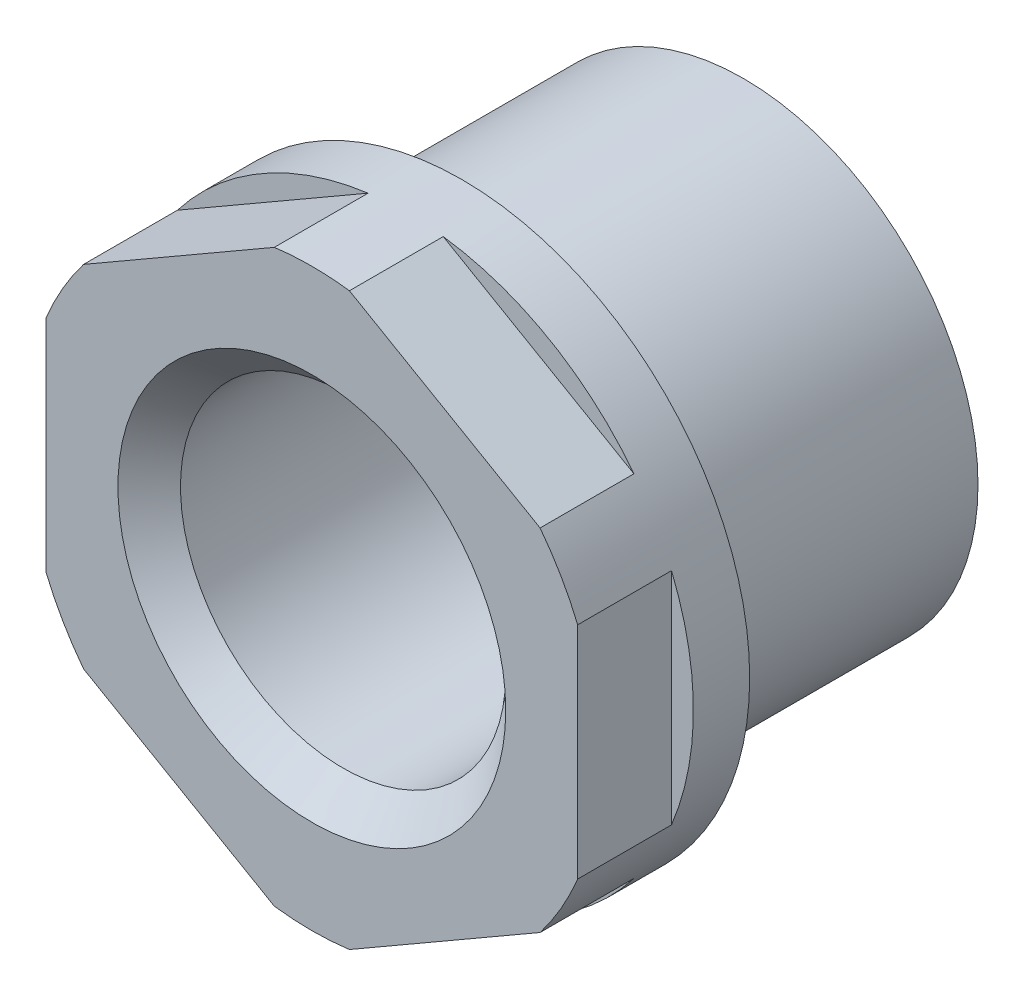
ISO-10303-21;
HEADER;
FILE_DESCRIPTION(('STEP AP214'),'2;1');
FILE_NAME('part.step','',(''),(''),'','','');
FILE_SCHEMA(('AUTOMOTIVE_DESIGN { 1 0 10303 214 1 1 1 1 }'));
ENDSEC;
DATA;
#1=APPLICATION_CONTEXT('core data for automotive mechanical design processes');
#2=APPLICATION_PROTOCOL_DEFINITION('international standard','automotive_design',2000,#1);
#3=PRODUCT_CONTEXT('',#1,'mechanical');
#4=PRODUCT('Part','Part','',(#3));
#5=PRODUCT_RELATED_PRODUCT_CATEGORY('part','',(#4));
#6=PRODUCT_DEFINITION_FORMATION('','',#4);
#7=PRODUCT_DEFINITION_CONTEXT('part definition',#1,'design');
#8=PRODUCT_DEFINITION('design','',#6,#7);
#9=PRODUCT_DEFINITION_SHAPE('','',#8);
#10=(LENGTH_UNIT() NAMED_UNIT(*) SI_UNIT(.MILLI.,.METRE.));
#11=(NAMED_UNIT(*) PLANE_ANGLE_UNIT() SI_UNIT($,.RADIAN.));
#12=(NAMED_UNIT(*) SI_UNIT($,.STERADIAN.) SOLID_ANGLE_UNIT());
#13=UNCERTAINTY_MEASURE_WITH_UNIT(LENGTH_MEASURE(1.E-05),#10,'distance_accuracy_value','');
#14=(GEOMETRIC_REPRESENTATION_CONTEXT(3) GLOBAL_UNCERTAINTY_ASSIGNED_CONTEXT((#13)) GLOBAL_UNIT_ASSIGNED_CONTEXT((#10,
#11,#12)) REPRESENTATION_CONTEXT('',''));
#15=CARTESIAN_POINT('',(0.,0.,0.));
#16=DIRECTION('',(0.,0.,1.));
#17=DIRECTION('',(1.,0.,0.));
#18=AXIS2_PLACEMENT_3D('',#15,#16,#17);
#19=CARTESIAN_POINT('',(-5.86092041698449,40.6504195270786,-29.4999999999845));
#20=DIRECTION('',(0.,0.,1.));
#21=DIRECTION('',(1.,0.,0.));
#22=AXIS2_PLACEMENT_3D('',#19,#20,#21);
#23=CONICAL_SURFACE('',#22,6.19999999996424,0.785398163394924);
#24=CARTESIAN_POINT('',(-5.86092041698449,40.6504195270786,-30.5));
#25=DIRECTION('',(0.,0.,-1.));
#26=DIRECTION('',(0.,1.,0.));
#27=AXIS2_PLACEMENT_3D('',#24,#25,#26);
#28=CIRCLE('',#27,5.2);
#29=CARTESIAN_POINT('',(-5.86092041698449,45.8504195270786,-30.5));
#30=VERTEX_POINT('',#29);
#31=EDGE_CURVE('E132',#30,#30,#28,.T.);
#32=ORIENTED_EDGE('',*,*,#31,.T.);
#33=EDGE_LOOP('',(#32));
#34=FACE_BOUND('',#33,.T.);
#35=CARTESIAN_POINT('',(-5.86092041698449,40.6504195270786,-29.4999999999845));
#36=DIRECTION('',(0.,0.,1.));
#37=DIRECTION('',(1.,0.,0.));
#38=AXIS2_PLACEMENT_3D('',#35,#36,#37);
#39=CIRCLE('',#38,6.19999999996424);
#40=CARTESIAN_POINT('',(0.339079582979749,40.6504195270786,-29.4999999999845));
#41=VERTEX_POINT('',#40);
#42=EDGE_CURVE('E21',#41,#41,#39,.F.);
#43=ORIENTED_EDGE('',*,*,#42,.F.);
#44=EDGE_LOOP('',(#43));
#45=FACE_BOUND('',#44,.T.);
#46=ADVANCED_FACE('F18',(#34,#45),#23,.F.);
#47=CARTESIAN_POINT('',(-5.86092041698449,40.6504195270786,-32.5));
#48=DIRECTION('',(0.,0.,1.));
#49=DIRECTION('',(0.,-1.,0.));
#50=AXIS2_PLACEMENT_3D('',#47,#48,#49);
#51=PLANE('',#50);
#52=CARTESIAN_POINT('',(-5.86092041698449,40.6504195270786,-32.5));
#53=DIRECTION('',(0.,0.,-1.));
#54=DIRECTION('',(0.,1.,0.));
#55=AXIS2_PLACEMENT_3D('',#52,#53,#54);
#56=CIRCLE('',#55,9.2);
#57=CARTESIAN_POINT('',(-13.1592806319197,46.2516638685665,-32.5));
#58=VERTEX_POINT('',#57);
#59=CARTESIAN_POINT('',(-7.06256020204926,49.7716070499261,-32.5));
#60=VERTEX_POINT('',#59);
#61=EDGE_CURVE('E125',#58,#60,#56,.T.);
#62=ORIENTED_EDGE('',*,*,#61,.F.);
#63=DIRECTION('',(0.866025403784439,0.5,0.));
#64=VECTOR('',#63,1.);
#65=CARTESIAN_POINT('',(-7.06256020204925,49.7716070499261,-32.5));
#66=LINE('',#65,#64);
#67=EDGE_CURVE('E121',#58,#60,#66,.T.);
#68=ORIENTED_EDGE('',*,*,#67,.T.);
#69=EDGE_LOOP('',(#62,#68));
#70=FACE_BOUND('',#69,.T.);
#71=ADVANCED_FACE('F247',(#70),#51,.T.);
#72=CARTESIAN_POINT('',(-7.06256020204925,49.7716070499261,-32.5));
#73=DIRECTION('',(0.5,-0.866025403784439,0.));
#74=DIRECTION('',(0.866025403784439,0.5,0.));
#75=AXIS2_PLACEMENT_3D('',#72,#73,#74);
#76=PLANE('',#75);
#77=ORIENTED_EDGE('',*,*,#67,.F.);
#78=DIRECTION('',(0.,0.,-1.));
#79=VECTOR('',#78,1.);
#80=CARTESIAN_POINT('',(-13.1592806319197,46.2516638685665,-34.3));
#81=LINE('',#80,#79);
#82=CARTESIAN_POINT('',(-13.1592806319197,46.2516638685665,-29.5));
#83=VERTEX_POINT('',#82);
#84=EDGE_CURVE('E119',#83,#58,#81,.T.);
#85=ORIENTED_EDGE('',*,*,#84,.F.);
#86=DIRECTION('',(-0.866025403784438,-0.5,0.));
#87=VECTOR('',#86,1.);
#88=CARTESIAN_POINT('',(-7.06256020204925,49.7716070499261,-29.5));
#89=LINE('',#88,#87);
#90=CARTESIAN_POINT('',(-7.06256020204926,49.7716070499261,-29.5));
#91=VERTEX_POINT('',#90);
#92=EDGE_CURVE('E105',#91,#83,#89,.T.);
#93=ORIENTED_EDGE('',*,*,#92,.F.);
#94=DIRECTION('',(0.,0.,-1.));
#95=VECTOR('',#94,1.);
#96=CARTESIAN_POINT('',(-7.06256020204926,49.7716070499261,-34.3));
#97=LINE('',#96,#95);
#98=EDGE_CURVE('E136',#60,#91,#97,.F.);
#99=ORIENTED_EDGE('',*,*,#98,.F.);
#100=EDGE_LOOP('',(#77,#85,#93,#99));
#101=FACE_BOUND('',#100,.T.);
#102=ADVANCED_FACE('F120',(#101),#76,.F.);
#103=CARTESIAN_POINT('',(-5.86092041698449,40.6504195270786,-32.5));
#104=DIRECTION('',(0.,0.,1.));
#105=DIRECTION('',(0.,-1.,0.));
#106=AXIS2_PLACEMENT_3D('',#103,#104,#105);
#107=PLANE('',#106);
#108=CARTESIAN_POINT('',(-5.86092041698449,40.6504195270786,-32.5));
#109=DIRECTION('',(0.,0.,-1.));
#110=DIRECTION('',(0.,1.,0.));
#111=AXIS2_PLACEMENT_3D('',#108,#109,#110);
#112=CIRCLE('',#111,9.2);
#113=CARTESIAN_POINT('',(-4.65928063191972,49.7716070499261,-32.5));
#114=VERTEX_POINT('',#113);
#115=CARTESIAN_POINT('',(1.43743979795075,46.2516638685665,-32.5));
#116=VERTEX_POINT('',#115);
#117=EDGE_CURVE('E139',#114,#116,#112,.T.);
#118=ORIENTED_EDGE('',*,*,#117,.F.);
#119=DIRECTION('',(0.866025403784439,-0.5,0.));
#120=VECTOR('',#119,1.);
#121=CARTESIAN_POINT('',(1.43743979795075,46.2516638685665,-32.5));
#122=LINE('',#121,#120);
#123=EDGE_CURVE('E184',#114,#116,#122,.T.);
#124=ORIENTED_EDGE('',*,*,#123,.T.);
#125=EDGE_LOOP('',(#118,#124));
#126=FACE_BOUND('',#125,.T.);
#127=ADVANCED_FACE('F254',(#126),#107,.T.);
#128=CARTESIAN_POINT('',(1.43743979795075,46.2516638685665,-32.5));
#129=DIRECTION('',(-0.5,-0.866025403784439,0.));
#130=DIRECTION('',(0.866025403784439,-0.5,0.));
#131=AXIS2_PLACEMENT_3D('',#128,#129,#130);
#132=PLANE('',#131);
#133=ORIENTED_EDGE('',*,*,#123,.F.);
#134=DIRECTION('',(0.,0.,-1.));
#135=VECTOR('',#134,1.);
#136=CARTESIAN_POINT('',(-4.65928063191972,49.7716070499261,-34.3));
#137=LINE('',#136,#135);
#138=CARTESIAN_POINT('',(-4.65928063191972,49.7716070499261,-29.5));
#139=VERTEX_POINT('',#138);
#140=EDGE_CURVE('E138',#139,#114,#137,.T.);
#141=ORIENTED_EDGE('',*,*,#140,.F.);
#142=DIRECTION('',(-0.866025403784439,0.5,0.));
#143=VECTOR('',#142,1.);
#144=CARTESIAN_POINT('',(1.43743979795075,46.2516638685665,-29.5));
#145=LINE('',#144,#143);
#146=CARTESIAN_POINT('',(1.43743979795075,46.2516638685665,-29.5));
#147=VERTEX_POINT('',#146);
#148=EDGE_CURVE('E116',#147,#139,#145,.T.);
#149=ORIENTED_EDGE('',*,*,#148,.F.);
#150=DIRECTION('',(0.,0.,-1.));
#151=VECTOR('',#150,1.);
#152=CARTESIAN_POINT('',(1.43743979795075,46.2516638685665,-34.3));
#153=LINE('',#152,#151);
#154=EDGE_CURVE('E142',#116,#147,#153,.F.);
#155=ORIENTED_EDGE('',*,*,#154,.F.);
#156=EDGE_LOOP('',(#133,#141,#149,#155));
#157=FACE_BOUND('',#156,.T.);
#158=ADVANCED_FACE('F245',(#157),#132,.F.);
#159=CARTESIAN_POINT('',(-5.86092041698449,40.6504195270786,-32.5));
#160=DIRECTION('',(0.,0.,1.));
#161=DIRECTION('',(0.,-1.,0.));
#162=AXIS2_PLACEMENT_3D('',#159,#160,#161);
#163=PLANE('',#162);
#164=DIRECTION('',(0.,-1.,0.));
#165=VECTOR('',#164,1.);
#166=CARTESIAN_POINT('',(2.63907958301552,37.130476345719,-32.5));
#167=LINE('',#166,#165);
#168=CARTESIAN_POINT('',(2.63907958301552,44.1703627084382,-32.5));
#169=VERTEX_POINT('',#168);
#170=CARTESIAN_POINT('',(2.63907958301552,37.130476345719,-32.5));
#171=VERTEX_POINT('',#170);
#172=EDGE_CURVE('E189',#169,#171,#167,.T.);
#173=ORIENTED_EDGE('',*,*,#172,.T.);
#174=CARTESIAN_POINT('',(-5.86092041698449,40.6504195270786,-32.5));
#175=DIRECTION('',(0.,0.,-1.));
#176=DIRECTION('',(0.,1.,0.));
#177=AXIS2_PLACEMENT_3D('',#174,#175,#176);
#178=CIRCLE('',#177,9.2);
#179=EDGE_CURVE('E147',#169,#171,#178,.T.);
#180=ORIENTED_EDGE('',*,*,#179,.F.);
#181=EDGE_LOOP('',(#173,#180));
#182=FACE_BOUND('',#181,.T.);
#183=ADVANCED_FACE('F300',(#182),#163,.T.);
#184=CARTESIAN_POINT('',(2.63907958301552,37.130476345719,-32.5));
#185=DIRECTION('',(-1.,0.,0.));
#186=DIRECTION('',(0.,-1.,0.));
#187=AXIS2_PLACEMENT_3D('',#184,#185,#186);
#188=PLANE('',#187);
#189=ORIENTED_EDGE('',*,*,#172,.F.);
#190=DIRECTION('',(0.,0.,-1.));
#191=VECTOR('',#190,1.);
#192=CARTESIAN_POINT('',(2.63907958301552,44.1703627084382,-34.3));
#193=LINE('',#192,#191);
#194=CARTESIAN_POINT('',(2.63907958301552,44.1703627084382,-29.5));
#195=VERTEX_POINT('',#194);
#196=EDGE_CURVE('E146',#195,#169,#193,.T.);
#197=ORIENTED_EDGE('',*,*,#196,.F.);
#198=DIRECTION('',(0.,-1.,0.));
#199=VECTOR('',#198,1.);
#200=CARTESIAN_POINT('',(2.63907958301552,40.6504195270786,-29.5));
#201=LINE('',#200,#199);
#202=CARTESIAN_POINT('',(2.63907958301552,37.130476345719,-29.5));
#203=VERTEX_POINT('',#202);
#204=EDGE_CURVE('E212',#203,#195,#201,.F.);
#205=ORIENTED_EDGE('',*,*,#204,.F.);
#206=DIRECTION('',(0.,0.,-1.));
#207=VECTOR('',#206,1.);
#208=CARTESIAN_POINT('',(2.63907958301552,37.130476345719,-34.3));
#209=LINE('',#208,#207);
#210=EDGE_CURVE('E150',#171,#203,#209,.F.);
#211=ORIENTED_EDGE('',*,*,#210,.F.);
#212=EDGE_LOOP('',(#189,#197,#205,#211));
#213=FACE_BOUND('',#212,.T.);
#214=ADVANCED_FACE('F238',(#213),#188,.F.);
#215=CARTESIAN_POINT('',(-5.86092041698449,40.6504195270786,-32.5));
#216=DIRECTION('',(0.,0.,1.));
#217=DIRECTION('',(0.,-1.,0.));
#218=AXIS2_PLACEMENT_3D('',#215,#216,#217);
#219=PLANE('',#218);
#220=CARTESIAN_POINT('',(-5.86092041698449,40.6504195270786,-32.5));
#221=DIRECTION('',(0.,0.,-1.));
#222=DIRECTION('',(0.,1.,0.));
#223=AXIS2_PLACEMENT_3D('',#220,#221,#222);
#224=CIRCLE('',#223,9.2);
#225=CARTESIAN_POINT('',(1.43743979795075,35.0491751855907,-32.5));
#226=VERTEX_POINT('',#225);
#227=CARTESIAN_POINT('',(-4.65928063191972,31.529232004231,-32.5));
#228=VERTEX_POINT('',#227);
#229=EDGE_CURVE('E155',#226,#228,#224,.T.);
#230=ORIENTED_EDGE('',*,*,#229,.F.);
#231=DIRECTION('',(-0.866025403784439,-0.5,0.));
#232=VECTOR('',#231,1.);
#233=CARTESIAN_POINT('',(-4.65928063191972,31.529232004231,-32.5));
#234=LINE('',#233,#232);
#235=EDGE_CURVE('E194',#226,#228,#234,.T.);
#236=ORIENTED_EDGE('',*,*,#235,.T.);
#237=EDGE_LOOP('',(#230,#236));
#238=FACE_BOUND('',#237,.T.);
#239=ADVANCED_FACE('F294',(#238),#219,.T.);
#240=CARTESIAN_POINT('',(-4.65928063191972,31.529232004231,-32.5));
#241=DIRECTION('',(-0.5,0.866025403784439,0.));
#242=DIRECTION('',(-0.866025403784439,-0.5,0.));
#243=AXIS2_PLACEMENT_3D('',#240,#241,#242);
#244=PLANE('',#243);
#245=ORIENTED_EDGE('',*,*,#235,.F.);
#246=DIRECTION('',(0.,0.,-1.));
#247=VECTOR('',#246,1.);
#248=CARTESIAN_POINT('',(1.43743979795075,35.0491751855906,-34.3));
#249=LINE('',#248,#247);
#250=CARTESIAN_POINT('',(1.43743979795075,35.0491751855906,-29.5));
#251=VERTEX_POINT('',#250);
#252=EDGE_CURVE('E154',#251,#226,#249,.T.);
#253=ORIENTED_EDGE('',*,*,#252,.F.);
#254=DIRECTION('',(0.866025403784439,0.5,0.));
#255=VECTOR('',#254,1.);
#256=CARTESIAN_POINT('',(-4.65928063191972,31.529232004231,-29.5));
#257=LINE('',#256,#255);
#258=CARTESIAN_POINT('',(-4.65928063191972,31.529232004231,-29.5));
#259=VERTEX_POINT('',#258);
#260=EDGE_CURVE('E210',#259,#251,#257,.T.);
#261=ORIENTED_EDGE('',*,*,#260,.F.);
#262=DIRECTION('',(0.,0.,-1.));
#263=VECTOR('',#262,1.);
#264=CARTESIAN_POINT('',(-4.65928063191972,31.529232004231,-34.3));
#265=LINE('',#264,#263);
#266=EDGE_CURVE('E158',#228,#259,#265,.F.);
#267=ORIENTED_EDGE('',*,*,#266,.F.);
#268=EDGE_LOOP('',(#245,#253,#261,#267));
#269=FACE_BOUND('',#268,.T.);
#270=ADVANCED_FACE('F233',(#269),#244,.F.);
#271=CARTESIAN_POINT('',(-5.86092041698449,40.6504195270786,-32.5));
#272=DIRECTION('',(0.,0.,1.));
#273=DIRECTION('',(0.,-1.,0.));
#274=AXIS2_PLACEMENT_3D('',#271,#272,#273);
#275=PLANE('',#274);
#276=CARTESIAN_POINT('',(-5.86092041698449,40.6504195270786,-32.5));
#277=DIRECTION('',(0.,0.,-1.));
#278=DIRECTION('',(0.,1.,0.));
#279=AXIS2_PLACEMENT_3D('',#276,#277,#278);
#280=CIRCLE('',#279,9.2);
#281=CARTESIAN_POINT('',(-7.06256020204926,31.529232004231,-32.5));
#282=VERTEX_POINT('',#281);
#283=CARTESIAN_POINT('',(-13.1592806319197,35.0491751855906,-32.5));
#284=VERTEX_POINT('',#283);
#285=EDGE_CURVE('E163',#282,#284,#280,.T.);
#286=ORIENTED_EDGE('',*,*,#285,.F.);
#287=DIRECTION('',(-0.866025403784438,0.500000000000001,0.));
#288=VECTOR('',#287,1.);
#289=CARTESIAN_POINT('',(-13.1592806319197,35.0491751855906,-32.5));
#290=LINE('',#289,#288);
#291=EDGE_CURVE('E200',#282,#284,#290,.T.);
#292=ORIENTED_EDGE('',*,*,#291,.T.);
#293=EDGE_LOOP('',(#286,#292));
#294=FACE_BOUND('',#293,.T.);
#295=ADVANCED_FACE('F288',(#294),#275,.T.);
#296=CARTESIAN_POINT('',(-13.1592806319197,35.0491751855906,-32.5));
#297=DIRECTION('',(0.500000000000001,0.866025403784438,0.));
#298=DIRECTION('',(-0.866025403784438,0.500000000000001,0.));
#299=AXIS2_PLACEMENT_3D('',#296,#297,#298);
#300=PLANE('',#299);
#301=ORIENTED_EDGE('',*,*,#291,.F.);
#302=DIRECTION('',(0.,0.,-1.));
#303=VECTOR('',#302,1.);
#304=CARTESIAN_POINT('',(-7.06256020204926,31.529232004231,-34.3));
#305=LINE('',#304,#303);
#306=CARTESIAN_POINT('',(-7.06256020204926,31.529232004231,-29.5));
#307=VERTEX_POINT('',#306);
#308=EDGE_CURVE('E162',#307,#282,#305,.T.);
#309=ORIENTED_EDGE('',*,*,#308,.F.);
#310=DIRECTION('',(0.866025403784439,-0.5,0.));
#311=VECTOR('',#310,1.);
#312=CARTESIAN_POINT('',(-13.1592806319197,35.0491751855906,-29.5));
#313=LINE('',#312,#311);
#314=CARTESIAN_POINT('',(-13.1592806319197,35.0491751855906,-29.5));
#315=VERTEX_POINT('',#314);
#316=EDGE_CURVE('E206',#315,#307,#313,.T.);
#317=ORIENTED_EDGE('',*,*,#316,.F.);
#318=DIRECTION('',(0.,0.,-1.));
#319=VECTOR('',#318,1.);
#320=CARTESIAN_POINT('',(-13.1592806319197,35.0491751855906,-34.3));
#321=LINE('',#320,#319);
#322=EDGE_CURVE('E166',#284,#315,#321,.F.);
#323=ORIENTED_EDGE('',*,*,#322,.F.);
#324=EDGE_LOOP('',(#301,#309,#317,#323));
#325=FACE_BOUND('',#324,.T.);
#326=ADVANCED_FACE('F228',(#325),#300,.F.);
#327=CARTESIAN_POINT('',(-5.86092041698449,40.6504195270786,-29.5));
#328=DIRECTION('',(0.,0.,1.));
#329=DIRECTION('',(0.,-1.,0.));
#330=AXIS2_PLACEMENT_3D('',#327,#328,#329);
#331=PLANE('',#330);
#332=ORIENTED_EDGE('',*,*,#42,.T.);
#333=EDGE_LOOP('',(#332));
#334=FACE_BOUND('',#333,.T.);
#335=ORIENTED_EDGE('',*,*,#92,.T.);
#336=CARTESIAN_POINT('',(-5.86092041698449,40.6504195270786,-29.5));
#337=DIRECTION('',(0.,0.,-1.));
#338=DIRECTION('',(0.,1.,0.));
#339=AXIS2_PLACEMENT_3D('',#336,#337,#338);
#340=CIRCLE('',#339,9.2);
#341=CARTESIAN_POINT('',(-14.3609204169845,44.1703627084382,-29.5));
#342=VERTEX_POINT('',#341);
#343=EDGE_CURVE('E109',#342,#83,#340,.T.);
#344=ORIENTED_EDGE('',*,*,#343,.F.);
#345=DIRECTION('',(0.,1.,0.));
#346=VECTOR('',#345,1.);
#347=CARTESIAN_POINT('',(-14.3609204169845,44.1703627084382,-29.5));
#348=LINE('',#347,#346);
#349=CARTESIAN_POINT('',(-14.3609204169845,37.130476345719,-29.5));
#350=VERTEX_POINT('',#349);
#351=EDGE_CURVE('E215',#342,#350,#348,.F.);
#352=ORIENTED_EDGE('',*,*,#351,.T.);
#353=CARTESIAN_POINT('',(-5.86092041698449,40.6504195270786,-29.5));
#354=DIRECTION('',(0.,0.,-1.));
#355=DIRECTION('',(0.,1.,0.));
#356=AXIS2_PLACEMENT_3D('',#353,#354,#355);
#357=CIRCLE('',#356,9.2);
#358=EDGE_CURVE('E167',#315,#350,#357,.T.);
#359=ORIENTED_EDGE('',*,*,#358,.F.);
#360=ORIENTED_EDGE('',*,*,#316,.T.);
#361=CARTESIAN_POINT('',(-5.86092041698449,40.6504195270786,-29.5));
#362=DIRECTION('',(0.,0.,-1.));
#363=DIRECTION('',(0.,1.,0.));
#364=AXIS2_PLACEMENT_3D('',#361,#362,#363);
#365=CIRCLE('',#364,9.2);
#366=EDGE_CURVE('E159',#259,#307,#365,.T.);
#367=ORIENTED_EDGE('',*,*,#366,.F.);
#368=ORIENTED_EDGE('',*,*,#260,.T.);
#369=CARTESIAN_POINT('',(-5.86092041698449,40.6504195270786,-29.5));
#370=DIRECTION('',(0.,0.,-1.));
#371=DIRECTION('',(0.,1.,0.));
#372=AXIS2_PLACEMENT_3D('',#369,#370,#371);
#373=CIRCLE('',#372,9.2);
#374=EDGE_CURVE('E151',#203,#251,#373,.T.);
#375=ORIENTED_EDGE('',*,*,#374,.F.);
#376=ORIENTED_EDGE('',*,*,#204,.T.);
#377=CARTESIAN_POINT('',(-5.86092041698449,40.6504195270786,-29.5));
#378=DIRECTION('',(0.,0.,-1.));
#379=DIRECTION('',(0.,1.,0.));
#380=AXIS2_PLACEMENT_3D('',#377,#378,#379);
#381=CIRCLE('',#380,9.2);
#382=EDGE_CURVE('E143',#147,#195,#381,.T.);
#383=ORIENTED_EDGE('',*,*,#382,.F.);
#384=ORIENTED_EDGE('',*,*,#148,.T.);
#385=CARTESIAN_POINT('',(-5.86092041698449,40.6504195270786,-29.5));
#386=DIRECTION('',(0.,0.,-1.));
#387=DIRECTION('',(0.,1.,0.));
#388=AXIS2_PLACEMENT_3D('',#385,#386,#387);
#389=CIRCLE('',#388,9.2);
#390=EDGE_CURVE('E112',#91,#139,#389,.T.);
#391=ORIENTED_EDGE('',*,*,#390,.F.);
#392=EDGE_LOOP('',(#335,#344,#352,#359,#360,#367,#368,#375,#376,#383,#384,#391));
#393=FACE_BOUND('',#392,.T.);
#394=ADVANCED_FACE('F107',(#334,#393),#331,.T.);
#395=CARTESIAN_POINT('',(-14.3609204169845,44.1703627084382,-32.5));
#396=DIRECTION('',(1.,0.,0.));
#397=DIRECTION('',(0.,0.,-1.));
#398=AXIS2_PLACEMENT_3D('',#395,#396,#397);
#399=PLANE('',#398);
#400=DIRECTION('',(0.,-1.,0.));
#401=VECTOR('',#400,1.);
#402=CARTESIAN_POINT('',(-14.3609204169845,40.6504195270786,-32.5));
#403=LINE('',#402,#401);
#404=CARTESIAN_POINT('',(-14.3609204169845,37.130476345719,-32.5));
#405=VERTEX_POINT('',#404);
#406=CARTESIAN_POINT('',(-14.3609204169845,44.1703627084382,-32.5));
#407=VERTEX_POINT('',#406);
#408=EDGE_CURVE('E36',#405,#407,#403,.F.);
#409=ORIENTED_EDGE('',*,*,#408,.F.);
#410=DIRECTION('',(0.,0.,-1.));
#411=VECTOR('',#410,1.);
#412=CARTESIAN_POINT('',(-14.3609204169845,37.130476345719,-34.3));
#413=LINE('',#412,#411);
#414=EDGE_CURVE('E170',#350,#405,#413,.T.);
#415=ORIENTED_EDGE('',*,*,#414,.F.);
#416=ORIENTED_EDGE('',*,*,#351,.F.);
#417=DIRECTION('',(0.,0.,-1.));
#418=VECTOR('',#417,1.);
#419=CARTESIAN_POINT('',(-14.3609204169845,44.1703627084382,-34.3));
#420=LINE('',#419,#418);
#421=EDGE_CURVE('E131',#407,#342,#420,.F.);
#422=ORIENTED_EDGE('',*,*,#421,.F.);
#423=EDGE_LOOP('',(#409,#415,#416,#422));
#424=FACE_BOUND('',#423,.T.);
#425=ADVANCED_FACE('F221',(#424),#399,.F.);
#426=CARTESIAN_POINT('',(-5.86092041698449,40.6504195270786,-32.5));
#427=DIRECTION('',(0.,0.,1.));
#428=DIRECTION('',(0.,-1.,0.));
#429=AXIS2_PLACEMENT_3D('',#426,#427,#428);
#430=PLANE('',#429);
#431=ORIENTED_EDGE('',*,*,#408,.T.);
#432=CARTESIAN_POINT('',(-5.86092041698449,40.6504195270786,-32.5));
#433=DIRECTION('',(0.,0.,-1.));
#434=DIRECTION('',(0.,1.,0.));
#435=AXIS2_PLACEMENT_3D('',#432,#433,#434);
#436=CIRCLE('',#435,9.2);
#437=EDGE_CURVE('E171',#405,#407,#436,.T.);
#438=ORIENTED_EDGE('',*,*,#437,.F.);
#439=EDGE_LOOP('',(#431,#438));
#440=FACE_BOUND('',#439,.T.);
#441=ADVANCED_FACE('F220',(#440),#430,.T.);
#442=CARTESIAN_POINT('',(-5.86092041698449,40.6504195270786,-34.3));
#443=DIRECTION('',(0.,0.,-1.));
#444=DIRECTION('',(0.,1.,0.));
#445=AXIS2_PLACEMENT_3D('',#442,#443,#444);
#446=CYLINDRICAL_SURFACE('',#445,5.2);
#447=CARTESIAN_POINT('',(-5.86092041698449,40.6504195270786,-43.3));
#448=DIRECTION('',(0.,0.,-1.));
#449=DIRECTION('',(0.,1.,0.));
#450=AXIS2_PLACEMENT_3D('',#447,#448,#449);
#451=CIRCLE('',#450,5.2);
#452=CARTESIAN_POINT('',(-5.86092041698449,45.8504195270786,-43.3));
#453=VERTEX_POINT('',#452);
#454=EDGE_CURVE('E173',#453,#453,#451,.F.);
#455=ORIENTED_EDGE('',*,*,#454,.F.);
#456=EDGE_LOOP('',(#455));
#457=FACE_BOUND('',#456,.T.);
#458=ORIENTED_EDGE('',*,*,#31,.F.);
#459=EDGE_LOOP('',(#458));
#460=FACE_BOUND('',#459,.T.);
#461=ADVANCED_FACE('F275',(#457,#460),#446,.F.);
#462=CARTESIAN_POINT('',(-5.86092041698449,40.6504195270786,-34.3));
#463=DIRECTION('',(0.,0.,-1.));
#464=DIRECTION('',(0.,1.,0.));
#465=AXIS2_PLACEMENT_3D('',#462,#463,#464);
#466=CYLINDRICAL_SURFACE('',#465,9.2);
#467=ORIENTED_EDGE('',*,*,#196,.T.);
#468=ORIENTED_EDGE('',*,*,#179,.T.);
#469=ORIENTED_EDGE('',*,*,#210,.T.);
#470=ORIENTED_EDGE('',*,*,#374,.T.);
#471=ORIENTED_EDGE('',*,*,#252,.T.);
#472=ORIENTED_EDGE('',*,*,#229,.T.);
#473=ORIENTED_EDGE('',*,*,#266,.T.);
#474=ORIENTED_EDGE('',*,*,#366,.T.);
#475=ORIENTED_EDGE('',*,*,#308,.T.);
#476=ORIENTED_EDGE('',*,*,#285,.T.);
#477=ORIENTED_EDGE('',*,*,#322,.T.);
#478=ORIENTED_EDGE('',*,*,#358,.T.);
#479=ORIENTED_EDGE('',*,*,#414,.T.);
#480=ORIENTED_EDGE('',*,*,#437,.T.);
#481=ORIENTED_EDGE('',*,*,#421,.T.);
#482=ORIENTED_EDGE('',*,*,#343,.T.);
#483=ORIENTED_EDGE('',*,*,#84,.T.);
#484=ORIENTED_EDGE('',*,*,#61,.T.);
#485=ORIENTED_EDGE('',*,*,#98,.T.);
#486=ORIENTED_EDGE('',*,*,#390,.T.);
#487=ORIENTED_EDGE('',*,*,#140,.T.);
#488=ORIENTED_EDGE('',*,*,#117,.T.);
#489=ORIENTED_EDGE('',*,*,#154,.T.);
#490=ORIENTED_EDGE('',*,*,#382,.T.);
#491=EDGE_LOOP('',(#467,#468,#469,#470,#471,#472,#473,#474,#475,#476,#477,#478,#479,#480,#481,
#482,#483,#484,#485,#486,#487,#488,#489,#490));
#492=FACE_BOUND('',#491,.T.);
#493=CARTESIAN_POINT('',(-5.86092041698449,40.6504195270786,-34.3));
#494=DIRECTION('',(0.,0.,-1.));
#495=DIRECTION('',(0.,1.,0.));
#496=AXIS2_PLACEMENT_3D('',#493,#494,#495);
#497=CIRCLE('',#496,9.2);
#498=CARTESIAN_POINT('',(-5.86092041698449,49.8504195270786,-34.3));
#499=VERTEX_POINT('',#498);
#500=EDGE_CURVE('E176',#499,#499,#497,.F.);
#501=ORIENTED_EDGE('',*,*,#500,.T.);
#502=EDGE_LOOP('',(#501));
#503=FACE_BOUND('',#502,.T.);
#504=ADVANCED_FACE('F128',(#492,#503),#466,.T.);
#505=CARTESIAN_POINT('',(-5.86092041698449,40.6504195270786,-43.3));
#506=DIRECTION('',(0.,0.,-1.));
#507=DIRECTION('',(-1.,0.,0.));
#508=AXIS2_PLACEMENT_3D('',#505,#506,#507);
#509=PLANE('',#508);
#510=ORIENTED_EDGE('',*,*,#454,.T.);
#511=EDGE_LOOP('',(#510));
#512=FACE_BOUND('',#511,.T.);
#513=CARTESIAN_POINT('',(-5.86092041698449,40.6504195270786,-43.3));
#514=DIRECTION('',(0.,0.,-1.));
#515=DIRECTION('',(0.,1.,0.));
#516=AXIS2_PLACEMENT_3D('',#513,#514,#515);
#517=CIRCLE('',#516,7.5);
#518=CARTESIAN_POINT('',(-5.86092041698449,48.1504195270786,-43.3));
#519=VERTEX_POINT('',#518);
#520=EDGE_CURVE('E27',#519,#519,#517,.F.);
#521=ORIENTED_EDGE('',*,*,#520,.F.);
#522=EDGE_LOOP('',(#521));
#523=FACE_BOUND('',#522,.T.);
#524=ADVANCED_FACE('F265',(#512,#523),#509,.T.);
#525=CARTESIAN_POINT('',(-5.86092041698449,40.6504195270786,-34.3));
#526=DIRECTION('',(0.,0.,1.));
#527=DIRECTION('',(0.,-1.,0.));
#528=AXIS2_PLACEMENT_3D('',#525,#526,#527);
#529=PLANE('',#528);
#530=CARTESIAN_POINT('',(-5.86092041698449,40.6504195270786,-34.3));
#531=DIRECTION('',(0.,0.,-1.));
#532=DIRECTION('',(0.,1.,0.));
#533=AXIS2_PLACEMENT_3D('',#530,#531,#532);
#534=CIRCLE('',#533,7.5);
#535=CARTESIAN_POINT('',(-5.86092041698449,48.1504195270786,-34.3));
#536=VERTEX_POINT('',#535);
#537=EDGE_CURVE('E11',#536,#536,#534,.T.);
#538=ORIENTED_EDGE('',*,*,#537,.F.);
#539=EDGE_LOOP('',(#538));
#540=FACE_BOUND('',#539,.T.);
#541=ORIENTED_EDGE('',*,*,#500,.F.);
#542=EDGE_LOOP('',(#541));
#543=FACE_BOUND('',#542,.T.);
#544=ADVANCED_FACE('F259',(#540,#543),#529,.F.);
#545=CARTESIAN_POINT('',(-5.86092041698449,40.6504195270786,-43.3));
#546=DIRECTION('',(0.,0.,-1.));
#547=DIRECTION('',(0.,1.,0.));
#548=AXIS2_PLACEMENT_3D('',#545,#546,#547);
#549=CYLINDRICAL_SURFACE('',#548,7.5);
#550=ORIENTED_EDGE('',*,*,#520,.T.);
#551=EDGE_LOOP('',(#550));
#552=FACE_BOUND('',#551,.T.);
#553=ORIENTED_EDGE('',*,*,#537,.T.);
#554=EDGE_LOOP('',(#553));
#555=FACE_BOUND('',#554,.T.);
#556=ADVANCED_FACE('F257',(#552,#555),#549,.T.);
#557=CLOSED_SHELL('',(#46,#71,#102,#127,#158,#183,#214,#239,#270,#295,#326,#394,#425,#441,#461,
#504,#524,#544,#556));
#558=MANIFOLD_SOLID_BREP('B1',#557);
#559=ADVANCED_BREP_SHAPE_REPRESENTATION('',(#18,#558),#14);
#560=SHAPE_DEFINITION_REPRESENTATION(#9,#559);
ENDSEC;
END-ISO-10303-21;
